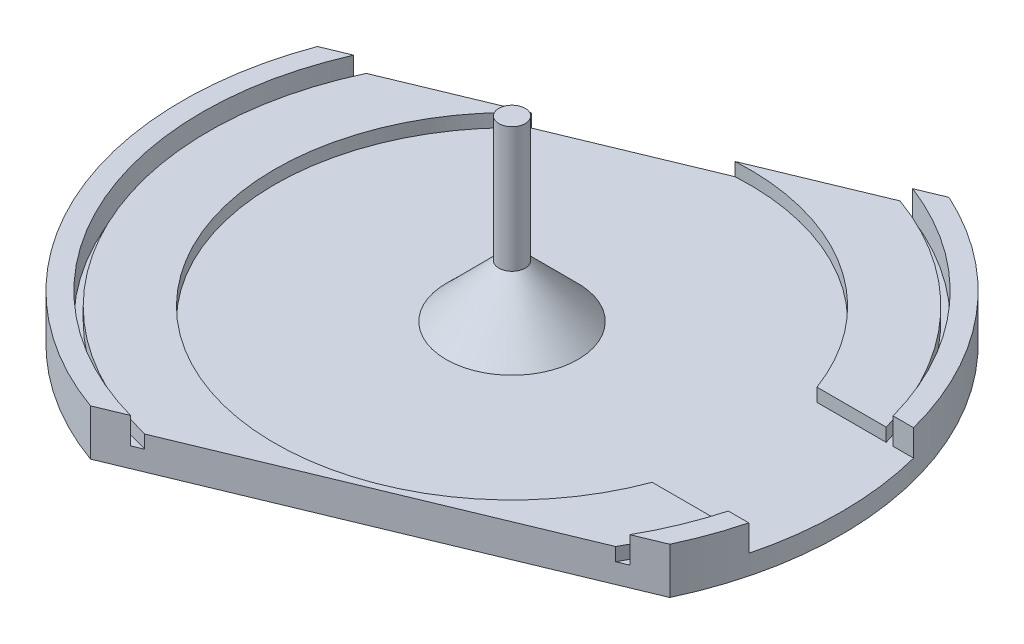
ISO-10303-21;
HEADER;
FILE_DESCRIPTION(('STEP AP214'),'2;1');
FILE_NAME('part.step','',(''),(''),'','','');
FILE_SCHEMA(('AUTOMOTIVE_DESIGN { 1 0 10303 214 1 1 1 1 }'));
ENDSEC;
DATA;
#1=APPLICATION_CONTEXT('core data for automotive mechanical design processes');
#2=APPLICATION_PROTOCOL_DEFINITION('international standard','automotive_design',2000,#1);
#3=PRODUCT_CONTEXT('',#1,'mechanical');
#4=PRODUCT('Part','Part','',(#3));
#5=PRODUCT_RELATED_PRODUCT_CATEGORY('part','',(#4));
#6=PRODUCT_DEFINITION_FORMATION('','',#4);
#7=PRODUCT_DEFINITION_CONTEXT('part definition',#1,'design');
#8=PRODUCT_DEFINITION('design','',#6,#7);
#9=PRODUCT_DEFINITION_SHAPE('','',#8);
#10=(LENGTH_UNIT() NAMED_UNIT(*) SI_UNIT(.MILLI.,.METRE.));
#11=(NAMED_UNIT(*) PLANE_ANGLE_UNIT() SI_UNIT($,.RADIAN.));
#12=(NAMED_UNIT(*) SI_UNIT($,.STERADIAN.) SOLID_ANGLE_UNIT());
#13=UNCERTAINTY_MEASURE_WITH_UNIT(LENGTH_MEASURE(1.E-05),#10,'distance_accuracy_value','');
#14=(GEOMETRIC_REPRESENTATION_CONTEXT(3) GLOBAL_UNCERTAINTY_ASSIGNED_CONTEXT((#13)) GLOBAL_UNIT_ASSIGNED_CONTEXT((#10,
#11,#12)) REPRESENTATION_CONTEXT('',''));
#15=CARTESIAN_POINT('',(0.,0.,0.));
#16=DIRECTION('',(0.,0.,1.));
#17=DIRECTION('',(1.,0.,0.));
#18=AXIS2_PLACEMENT_3D('',#15,#16,#17);
#19=CARTESIAN_POINT('',(0.,3.,0.));
#20=DIRECTION('',(0.,-1.,0.));
#21=DIRECTION('',(0.,0.,-1.));
#22=AXIS2_PLACEMENT_3D('',#19,#20,#21);
#23=CYLINDRICAL_SURFACE('',#22,50.);
#24=DIRECTION('',(0.,-1.,0.));
#25=VECTOR('',#24,1.);
#26=CARTESIAN_POINT('',(-46.8880949091429,10.,-17.3639441311934));
#27=LINE('',#26,#25);
#28=CARTESIAN_POINT('',(-46.8880949091429,7.,-17.3639441311934));
#29=VERTEX_POINT('',#28);
#30=CARTESIAN_POINT('',(-46.8880949091429,0.,-17.3639441311934));
#31=VERTEX_POINT('',#30);
#32=EDGE_CURVE('E225',#29,#31,#27,.T.);
#33=ORIENTED_EDGE('',*,*,#32,.T.);
#34=CARTESIAN_POINT('',(0.,0.,0.));
#35=DIRECTION('',(0.,1.,0.));
#36=DIRECTION('',(0.,0.,1.));
#37=AXIS2_PLACEMENT_3D('',#34,#35,#36);
#38=CIRCLE('',#37,50.);
#39=CARTESIAN_POINT('',(-16.8924773061934,0.,47.0600064859722));
#40=VERTEX_POINT('',#39);
#41=EDGE_CURVE('E239',#31,#40,#38,.T.);
#42=ORIENTED_EDGE('',*,*,#41,.T.);
#43=DIRECTION('',(0.,-1.,0.));
#44=VECTOR('',#43,1.);
#45=CARTESIAN_POINT('',(-16.8924773061934,10.,47.0600064859722));
#46=LINE('',#45,#44);
#47=CARTESIAN_POINT('',(-16.8924773061934,7.,47.0600064859722));
#48=VERTEX_POINT('',#47);
#49=EDGE_CURVE('E233',#48,#40,#46,.T.);
#50=ORIENTED_EDGE('',*,*,#49,.F.);
#51=CARTESIAN_POINT('',(0.,7.,0.));
#52=DIRECTION('',(0.,1.,0.));
#53=DIRECTION('',(0.,0.,1.));
#54=AXIS2_PLACEMENT_3D('',#51,#52,#53);
#55=CIRCLE('',#54,50.);
#56=EDGE_CURVE('E241',#29,#48,#55,.T.);
#57=ORIENTED_EDGE('',*,*,#56,.F.);
#58=EDGE_LOOP('',(#33,#42,#50,#57));
#59=FACE_BOUND('',#58,.T.);
#60=ADVANCED_FACE('F75',(#59),#23,.T.);
#61=CARTESIAN_POINT('',(0.,7.,0.));
#62=DIRECTION('',(0.,1.,0.));
#63=DIRECTION('',(0.,0.,1.));
#64=AXIS2_PLACEMENT_3D('',#61,#62,#63);
#65=PLANE('',#64);
#66=CARTESIAN_POINT('',(0.,7.,0.));
#67=DIRECTION('',(0.,1.,0.));
#68=DIRECTION('',(0.,0.,1.));
#69=AXIS2_PLACEMENT_3D('',#66,#67,#68);
#70=CIRCLE('',#69,47.);
#71=CARTESIAN_POINT('',(-42.9986049840917,7.,-18.9768271695256));
#72=VERTEX_POINT('',#71);
#73=CARTESIAN_POINT('',(-12.5993682383666,7.,45.2797517660382));
#74=VERTEX_POINT('',#73);
#75=EDGE_CURVE('E351',#72,#74,#70,.T.);
#76=ORIENTED_EDGE('',*,*,#75,.F.);
#77=DIRECTION('',(-0.923728021347068,0.,0.383049008063237));
#78=VECTOR('',#77,1.);
#79=CARTESIAN_POINT('',(-13.0236662741541,7.,-31.40675272581));
#80=LINE('',#79,#78);
#81=EDGE_CURVE('E416',#72,#29,#80,.T.);
#82=ORIENTED_EDGE('',*,*,#81,.T.);
#83=ORIENTED_EDGE('',*,*,#56,.T.);
#84=DIRECTION('',(0.923728021347069,0.,-0.383049008063236));
#85=VECTOR('',#84,1.);
#86=CARTESIAN_POINT('',(14.1728132983394,7.,34.1779367898408));
#87=LINE('',#86,#85);
#88=EDGE_CURVE('E433',#48,#74,#87,.T.);
#89=ORIENTED_EDGE('',*,*,#88,.T.);
#90=EDGE_LOOP('',(#76,#82,#83,#89));
#91=FACE_BOUND('',#90,.T.);
#92=ADVANCED_FACE('F451',(#91),#65,.T.);
#93=CARTESIAN_POINT('',(40.9449948350454,7.,23.0761218136434));
#94=VERTEX_POINT('',#93);
#95=CARTESIAN_POINT('',(45.3072841825683,7.,12.5));
#96=VERTEX_POINT('',#95);
#97=EDGE_CURVE('E348',#94,#96,#70,.T.);
#98=ORIENTED_EDGE('',*,*,#97,.F.);
#99=DIRECTION('',(0.923728021347069,0.,-0.383049008063236));
#100=VECTOR('',#99,1.);
#101=CARTESIAN_POINT('',(14.1728132983394,7.,34.1779367898408));
#102=LINE('',#101,#100);
#103=CARTESIAN_POINT('',(45.2381039028722,7.,21.2958670937095));
#104=VERTEX_POINT('',#103);
#105=EDGE_CURVE('E372',#94,#104,#102,.T.);
#106=ORIENTED_EDGE('',*,*,#105,.T.);
#107=CARTESIAN_POINT('',(48.4122918275927,7.,12.5));
#108=VERTEX_POINT('',#107);
#109=EDGE_CURVE('E252',#104,#108,#55,.T.);
#110=ORIENTED_EDGE('',*,*,#109,.T.);
#111=DIRECTION('',(1.,0.,0.));
#112=VECTOR('',#111,1.);
#113=CARTESIAN_POINT('',(0.,7.,12.5));
#114=LINE('',#113,#112);
#115=EDGE_CURVE('E327',#96,#108,#114,.T.);
#116=ORIENTED_EDGE('',*,*,#115,.F.);
#117=EDGE_LOOP('',(#98,#106,#110,#116));
#118=FACE_BOUND('',#117,.T.);
#119=ADVANCED_FACE('F370',(#118),#65,.T.);
#120=CARTESIAN_POINT('',(0.,7.,0.));
#121=DIRECTION('',(0.,-1.,0.));
#122=DIRECTION('',(0.,0.,-1.));
#123=AXIS2_PLACEMENT_3D('',#120,#121,#122);
#124=CYLINDRICAL_SURFACE('',#123,47.);
#125=CARTESIAN_POINT('',(0.,3.,0.));
#126=DIRECTION('',(0.,1.,0.));
#127=DIRECTION('',(0.,0.,1.));
#128=AXIS2_PLACEMENT_3D('',#125,#126,#127);
#129=CIRCLE('',#128,47.);
#130=CARTESIAN_POINT('',(-12.5993682383666,3.,45.2797517660382));
#131=VERTEX_POINT('',#130);
#132=CARTESIAN_POINT('',(-42.9986049840917,3.,-18.9768271695256));
#133=VERTEX_POINT('',#132);
#134=EDGE_CURVE('E259',#131,#133,#129,.F.);
#135=ORIENTED_EDGE('',*,*,#134,.T.);
#136=DIRECTION('',(0.,-1.,0.));
#137=VECTOR('',#136,1.);
#138=CARTESIAN_POINT('',(-42.9986049840917,7.,-18.9768271695256));
#139=LINE('',#138,#137);
#140=EDGE_CURVE('E402',#133,#72,#139,.F.);
#141=ORIENTED_EDGE('',*,*,#140,.T.);
#142=ORIENTED_EDGE('',*,*,#75,.T.);
#143=DIRECTION('',(0.,-1.,0.));
#144=VECTOR('',#143,1.);
#145=CARTESIAN_POINT('',(-12.5993682383666,7.,45.2797517660382));
#146=LINE('',#145,#144);
#147=EDGE_CURVE('E404',#74,#131,#146,.T.);
#148=ORIENTED_EDGE('',*,*,#147,.T.);
#149=EDGE_LOOP('',(#135,#141,#142,#148));
#150=FACE_BOUND('',#149,.T.);
#151=ADVANCED_FACE('F401',(#150),#124,.F.);
#152=CARTESIAN_POINT('',(45.3072841825683,3.00000000000001,12.5));
#153=VERTEX_POINT('',#152);
#154=CARTESIAN_POINT('',(40.9449948350454,3.,23.0761218136434));
#155=VERTEX_POINT('',#154);
#156=EDGE_CURVE('E255',#153,#155,#129,.F.);
#157=ORIENTED_EDGE('',*,*,#156,.T.);
#158=DIRECTION('',(0.,-1.,0.));
#159=VECTOR('',#158,1.);
#160=CARTESIAN_POINT('',(40.9449948350454,7.,23.0761218136434));
#161=LINE('',#160,#159);
#162=EDGE_CURVE('E363',#155,#94,#161,.F.);
#163=ORIENTED_EDGE('',*,*,#162,.T.);
#164=ORIENTED_EDGE('',*,*,#97,.T.);
#165=DIRECTION('',(0.,-1.,0.));
#166=VECTOR('',#165,1.);
#167=CARTESIAN_POINT('',(45.3072841825683,7.,12.5));
#168=LINE('',#167,#166);
#169=EDGE_CURVE('E324',#153,#96,#168,.F.);
#170=ORIENTED_EDGE('',*,*,#169,.F.);
#171=EDGE_LOOP('',(#157,#163,#164,#170));
#172=FACE_BOUND('',#171,.T.);
#173=ADVANCED_FACE('F361',(#172),#124,.F.);
#174=CARTESIAN_POINT('',(0.,3.,0.));
#175=DIRECTION('',(0.,1.,0.));
#176=DIRECTION('',(0.,0.,1.));
#177=AXIS2_PLACEMENT_3D('',#174,#175,#176);
#178=PLANE('',#177);
#179=CARTESIAN_POINT('',(0.,3.,0.));
#180=DIRECTION('',(0.,1.,0.));
#181=DIRECTION('',(0.,0.,1.));
#182=AXIS2_PLACEMENT_3D('',#179,#180,#181);
#183=CIRCLE('',#182,46.);
#184=CARTESIAN_POINT('',(-41.6443322189621,3.,-19.5384132937328));
#185=VERTEX_POINT('',#184);
#186=CARTESIAN_POINT('',(-11.0738750526922,3.,44.6471644263929));
#187=VERTEX_POINT('',#186);
#188=EDGE_CURVE('E346',#185,#187,#183,.T.);
#189=ORIENTED_EDGE('',*,*,#188,.F.);
#190=DIRECTION('',(-0.923728021347068,0.,0.383049008063237));
#191=VECTOR('',#190,1.);
#192=CARTESIAN_POINT('',(-13.0236662741541,3.,-31.40675272581));
#193=LINE('',#192,#191);
#194=EDGE_CURVE('E412',#185,#133,#193,.T.);
#195=ORIENTED_EDGE('',*,*,#194,.T.);
#196=ORIENTED_EDGE('',*,*,#134,.F.);
#197=DIRECTION('',(0.923728021347069,0.,-0.383049008063236));
#198=VECTOR('',#197,1.);
#199=CARTESIAN_POINT('',(14.1728132983394,3.,34.1779367898408));
#200=LINE('',#199,#198);
#201=EDGE_CURVE('E410',#131,#187,#200,.T.);
#202=ORIENTED_EDGE('',*,*,#201,.T.);
#203=EDGE_LOOP('',(#189,#195,#196,#202));
#204=FACE_BOUND('',#203,.T.);
#205=ADVANCED_FACE('F409',(#204),#178,.T.);
#206=CARTESIAN_POINT('',(0.,5.,0.));
#207=DIRECTION('',(0.,-1.,0.));
#208=DIRECTION('',(0.,0.,-1.));
#209=AXIS2_PLACEMENT_3D('',#206,#207,#208);
#210=CYLINDRICAL_SURFACE('',#209,46.);
#211=DIRECTION('',(0.,-1.,0.));
#212=VECTOR('',#211,1.);
#213=CARTESIAN_POINT('',(-41.6443322189621,5.,-19.5384132937328));
#214=LINE('',#213,#212);
#215=CARTESIAN_POINT('',(-41.6443322189621,5.,-19.5384132937328));
#216=VERTEX_POINT('',#215);
#217=EDGE_CURVE('E414',#185,#216,#214,.F.);
#218=ORIENTED_EDGE('',*,*,#217,.F.);
#219=ORIENTED_EDGE('',*,*,#188,.T.);
#220=DIRECTION('',(0.,-1.,0.));
#221=VECTOR('',#220,1.);
#222=CARTESIAN_POINT('',(-11.0738750526922,5.,44.6471644263929));
#223=LINE('',#222,#221);
#224=CARTESIAN_POINT('',(-11.0738750526922,5.,44.6471644263929));
#225=VERTEX_POINT('',#224);
#226=EDGE_CURVE('E429',#225,#187,#223,.T.);
#227=ORIENTED_EDGE('',*,*,#226,.F.);
#228=CARTESIAN_POINT('',(0.,5.,0.));
#229=DIRECTION('',(0.,1.,0.));
#230=DIRECTION('',(0.,0.,1.));
#231=AXIS2_PLACEMENT_3D('',#228,#229,#230);
#232=CIRCLE('',#231,46.);
#233=EDGE_CURVE('E343',#216,#225,#232,.T.);
#234=ORIENTED_EDGE('',*,*,#233,.F.);
#235=EDGE_LOOP('',(#218,#219,#227,#234));
#236=FACE_BOUND('',#235,.T.);
#237=ADVANCED_FACE('F449',(#236),#210,.T.);
#238=DIRECTION('',(0.,-1.,0.));
#239=VECTOR('',#238,1.);
#240=CARTESIAN_POINT('',(39.419501649371,5.,23.7087091532887));
#241=LINE('',#240,#239);
#242=CARTESIAN_POINT('',(39.419501649371,3.,23.7087091532887));
#243=VERTEX_POINT('',#242);
#244=CARTESIAN_POINT('',(39.419501649371,5.,23.7087091532887));
#245=VERTEX_POINT('',#244);
#246=EDGE_CURVE('E91',#243,#245,#241,.F.);
#247=ORIENTED_EDGE('',*,*,#246,.F.);
#248=CARTESIAN_POINT('',(44.2690636901211,3.00000000000001,12.5));
#249=VERTEX_POINT('',#248);
#250=EDGE_CURVE('E338',#243,#249,#183,.T.);
#251=ORIENTED_EDGE('',*,*,#250,.T.);
#252=DIRECTION('',(0.,-1.,0.));
#253=VECTOR('',#252,1.);
#254=CARTESIAN_POINT('',(44.2690636901211,5.,12.5));
#255=LINE('',#254,#253);
#256=CARTESIAN_POINT('',(44.2690636901211,5.,12.5));
#257=VERTEX_POINT('',#256);
#258=EDGE_CURVE('E321',#249,#257,#255,.F.);
#259=ORIENTED_EDGE('',*,*,#258,.T.);
#260=EDGE_CURVE('E344',#245,#257,#232,.T.);
#261=ORIENTED_EDGE('',*,*,#260,.F.);
#262=EDGE_LOOP('',(#247,#251,#259,#261));
#263=FACE_BOUND('',#262,.T.);
#264=ADVANCED_FACE('F439',(#263),#210,.T.);
#265=DIRECTION('',(0.,-1.,0.));
#266=VECTOR('',#265,1.);
#267=CARTESIAN_POINT('',(20.8407623608348,10.,-45.4495613204265));
#268=LINE('',#267,#266);
#269=CARTESIAN_POINT('',(20.8407623608348,7.,-45.4495613204265));
#270=VERTEX_POINT('',#269);
#271=CARTESIAN_POINT('',(20.8407623608348,0.,-45.4495613204265));
#272=VERTEX_POINT('',#271);
#273=EDGE_CURVE('E228',#270,#272,#268,.T.);
#274=ORIENTED_EDGE('',*,*,#273,.F.);
#275=CARTESIAN_POINT('',(48.4122918275927,7.,-12.5));
#276=VERTEX_POINT('',#275);
#277=EDGE_CURVE('E247',#276,#270,#55,.T.);
#278=ORIENTED_EDGE('',*,*,#277,.F.);
#279=DIRECTION('',(0.,-1.,0.));
#280=VECTOR('',#279,1.);
#281=CARTESIAN_POINT('',(48.4122918275927,3.,-12.5));
#282=LINE('',#281,#280);
#283=CARTESIAN_POINT('',(48.4122918275927,3.00000000000001,-12.5));
#284=VERTEX_POINT('',#283);
#285=EDGE_CURVE('E312',#276,#284,#282,.T.);
#286=ORIENTED_EDGE('',*,*,#285,.T.);
#287=CARTESIAN_POINT('',(0.,3.00000000000001,0.));
#288=DIRECTION('',(0.,-1.,0.));
#289=DIRECTION('',(0.,0.,-1.));
#290=AXIS2_PLACEMENT_3D('',#287,#288,#289);
#291=CIRCLE('',#290,50.);
#292=CARTESIAN_POINT('',(48.4122918275927,3.00000000000001,12.5));
#293=VERTEX_POINT('',#292);
#294=EDGE_CURVE('E333',#284,#293,#291,.T.);
#295=ORIENTED_EDGE('',*,*,#294,.T.);
#296=DIRECTION('',(0.,-1.,0.));
#297=VECTOR('',#296,1.);
#298=CARTESIAN_POINT('',(48.4122918275927,3.,12.5));
#299=LINE('',#298,#297);
#300=EDGE_CURVE('E330',#293,#108,#299,.F.);
#301=ORIENTED_EDGE('',*,*,#300,.T.);
#302=ORIENTED_EDGE('',*,*,#109,.F.);
#303=DIRECTION('',(0.,-1.,0.));
#304=VECTOR('',#303,1.);
#305=CARTESIAN_POINT('',(45.2381039028722,10.,21.2958670937095));
#306=LINE('',#305,#304);
#307=CARTESIAN_POINT('',(45.2381039028722,0.,21.2958670937095));
#308=VERTEX_POINT('',#307);
#309=EDGE_CURVE('E376',#104,#308,#306,.T.);
#310=ORIENTED_EDGE('',*,*,#309,.T.);
#311=EDGE_CURVE('E246',#308,#272,#38,.T.);
#312=ORIENTED_EDGE('',*,*,#311,.T.);
#313=EDGE_LOOP('',(#274,#278,#286,#295,#301,#302,#310,#312));
#314=FACE_BOUND('',#313,.T.);
#315=ADVANCED_FACE('F375',(#314),#23,.T.);
#316=CARTESIAN_POINT('',(0.,0.,0.));
#317=DIRECTION('',(0.,1.,0.));
#318=DIRECTION('',(0.,0.,1.));
#319=AXIS2_PLACEMENT_3D('',#316,#317,#318);
#320=PLANE('',#319);
#321=DIRECTION('',(0.923728021347069,0.,-0.383049008063237));
#322=VECTOR('',#321,1.);
#323=CARTESIAN_POINT('',(-13.0236662741541,0.,-31.40675272581));
#324=LINE('',#323,#322);
#325=EDGE_CURVE('E222',#31,#272,#324,.T.);
#326=ORIENTED_EDGE('',*,*,#325,.T.);
#327=ORIENTED_EDGE('',*,*,#311,.F.);
#328=DIRECTION('',(-0.923728021347069,0.,0.383049008063236));
#329=VECTOR('',#328,1.);
#330=CARTESIAN_POINT('',(14.1728132983394,0.,34.1779367898408));
#331=LINE('',#330,#329);
#332=EDGE_CURVE('E245',#308,#40,#331,.T.);
#333=ORIENTED_EDGE('',*,*,#332,.T.);
#334=ORIENTED_EDGE('',*,*,#41,.F.);
#335=EDGE_LOOP('',(#326,#327,#333,#334));
#336=FACE_BOUND('',#335,.T.);
#337=ADVANCED_FACE('F244',(#336),#320,.F.);
#338=ORIENTED_EDGE('',*,*,#277,.T.);
#339=DIRECTION('',(-0.923728021347068,0.,0.383049008063237));
#340=VECTOR('',#339,1.);
#341=CARTESIAN_POINT('',(-13.0236662741541,7.,-31.40675272581));
#342=LINE('',#341,#340);
#343=CARTESIAN_POINT('',(16.9512724357836,7.,-43.8366782820944));
#344=VERTEX_POINT('',#343);
#345=EDGE_CURVE('E393',#270,#344,#342,.T.);
#346=ORIENTED_EDGE('',*,*,#345,.T.);
#347=CARTESIAN_POINT('',(45.3072841825683,7.,-12.5));
#348=VERTEX_POINT('',#347);
#349=EDGE_CURVE('E349',#348,#344,#70,.T.);
#350=ORIENTED_EDGE('',*,*,#349,.F.);
#351=DIRECTION('',(-1.,0.,0.));
#352=VECTOR('',#351,1.);
#353=CARTESIAN_POINT('',(0.,7.,-12.5));
#354=LINE('',#353,#352);
#355=EDGE_CURVE('E310',#276,#348,#354,.T.);
#356=ORIENTED_EDGE('',*,*,#355,.F.);
#357=EDGE_LOOP('',(#338,#346,#350,#356));
#358=FACE_BOUND('',#357,.T.);
#359=ADVANCED_FACE('F392',(#358),#65,.T.);
#360=ORIENTED_EDGE('',*,*,#349,.T.);
#361=DIRECTION('',(0.,-1.,0.));
#362=VECTOR('',#361,1.);
#363=CARTESIAN_POINT('',(16.9512724357836,7.,-43.8366782820944));
#364=LINE('',#363,#362);
#365=CARTESIAN_POINT('',(16.9512724357836,3.,-43.8366782820944));
#366=VERTEX_POINT('',#365);
#367=EDGE_CURVE('E395',#344,#366,#364,.T.);
#368=ORIENTED_EDGE('',*,*,#367,.T.);
#369=CARTESIAN_POINT('',(45.3072841825683,3.,-12.5));
#370=VERTEX_POINT('',#369);
#371=EDGE_CURVE('E249',#366,#370,#129,.F.);
#372=ORIENTED_EDGE('',*,*,#371,.T.);
#373=DIRECTION('',(0.,-1.,0.));
#374=VECTOR('',#373,1.);
#375=CARTESIAN_POINT('',(45.3072841825683,7.,-12.5));
#376=LINE('',#375,#374);
#377=EDGE_CURVE('E307',#348,#370,#376,.T.);
#378=ORIENTED_EDGE('',*,*,#377,.F.);
#379=EDGE_LOOP('',(#360,#368,#372,#378));
#380=FACE_BOUND('',#379,.T.);
#381=ADVANCED_FACE('F394',(#380),#124,.F.);
#382=CARTESIAN_POINT('',(0.,3.,0.));
#383=DIRECTION('',(0.,1.,0.));
#384=DIRECTION('',(0.,0.,1.));
#385=AXIS2_PLACEMENT_3D('',#382,#383,#384);
#386=CIRCLE('',#385,9.99999999999997);
#387=CARTESIAN_POINT('',(0.,3.,9.99999999999997));
#388=VERTEX_POINT('',#387);
#389=EDGE_CURVE('E262',#388,#388,#386,.F.);
#390=ORIENTED_EDGE('',*,*,#389,.T.);
#391=EDGE_LOOP('',(#390));
#392=FACE_BOUND('',#391,.T.);
#393=ORIENTED_EDGE('',*,*,#371,.F.);
#394=DIRECTION('',(-0.923728021347068,0.,0.383049008063237));
#395=VECTOR('',#394,1.);
#396=CARTESIAN_POINT('',(-13.0236662741541,3.,-31.40675272581));
#397=LINE('',#396,#395);
#398=CARTESIAN_POINT('',(15.596999670654,3.,-43.2750921578871));
#399=VERTEX_POINT('',#398);
#400=EDGE_CURVE('E425',#366,#399,#397,.T.);
#401=ORIENTED_EDGE('',*,*,#400,.T.);
#402=CARTESIAN_POINT('',(44.2690636901211,3.00000000000001,-12.5));
#403=VERTEX_POINT('',#402);
#404=EDGE_CURVE('E291',#403,#399,#183,.T.);
#405=ORIENTED_EDGE('',*,*,#404,.F.);
#406=DIRECTION('',(1.,0.,0.));
#407=VECTOR('',#406,1.);
#408=CARTESIAN_POINT('',(21.,3.00000000000001,-12.5));
#409=LINE('',#408,#407);
#410=CARTESIAN_POINT('',(33.7601836487896,3.,-12.5));
#411=VERTEX_POINT('',#410);
#412=EDGE_CURVE('E287',#411,#403,#409,.T.);
#413=ORIENTED_EDGE('',*,*,#412,.F.);
#414=CARTESIAN_POINT('',(0.,3.,0.));
#415=DIRECTION('',(0.,1.,0.));
#416=DIRECTION('',(0.,0.,1.));
#417=AXIS2_PLACEMENT_3D('',#414,#415,#416);
#418=CIRCLE('',#417,36.);
#419=CARTESIAN_POINT('',(-2.09396892983373,3.,-35.939049710877));
#420=VERTEX_POINT('',#419);
#421=EDGE_CURVE('E265',#420,#411,#418,.F.);
#422=ORIENTED_EDGE('',*,*,#421,.F.);
#423=CARTESIAN_POINT('',(-23.9533636184744,3.,-26.8744557407429));
#424=VERTEX_POINT('',#423);
#425=EDGE_CURVE('E285',#420,#424,#397,.T.);
#426=ORIENTED_EDGE('',*,*,#425,.T.);
#427=CARTESIAN_POINT('',(33.7601836487896,3.00000000000001,12.5));
#428=VERTEX_POINT('',#427);
#429=EDGE_CURVE('E266',#428,#424,#418,.F.);
#430=ORIENTED_EDGE('',*,*,#429,.F.);
#431=DIRECTION('',(1.,0.,0.));
#432=VECTOR('',#431,1.);
#433=CARTESIAN_POINT('',(21.,3.00000000000001,12.5));
#434=LINE('',#433,#432);
#435=EDGE_CURVE('E380',#428,#249,#434,.T.);
#436=ORIENTED_EDGE('',*,*,#435,.T.);
#437=ORIENTED_EDGE('',*,*,#250,.F.);
#438=DIRECTION('',(0.923728021347069,0.,-0.383049008063236));
#439=VECTOR('',#438,1.);
#440=CARTESIAN_POINT('',(14.1728132983394,3.,34.1779367898408));
#441=LINE('',#440,#439);
#442=EDGE_CURVE('E383',#243,#155,#441,.T.);
#443=ORIENTED_EDGE('',*,*,#442,.T.);
#444=ORIENTED_EDGE('',*,*,#156,.F.);
#445=EDGE_CURVE('E304',#153,#293,#434,.T.);
#446=ORIENTED_EDGE('',*,*,#445,.T.);
#447=ORIENTED_EDGE('',*,*,#294,.F.);
#448=EDGE_CURVE('E295',#370,#284,#409,.T.);
#449=ORIENTED_EDGE('',*,*,#448,.F.);
#450=EDGE_LOOP('',(#393,#401,#405,#413,#422,#426,#430,#436,#437,#443,#444,#446,#447,#449));
#451=FACE_BOUND('',#450,.T.);
#452=ADVANCED_FACE('F283',(#392,#451),#178,.T.);
#453=CARTESIAN_POINT('',(0.,5.,0.));
#454=DIRECTION('',(0.,1.,0.));
#455=DIRECTION('',(0.,0.,1.));
#456=AXIS2_PLACEMENT_3D('',#453,#454,#455);
#457=PLANE('',#456);
#458=CARTESIAN_POINT('',(44.2690636901211,5.,-12.5));
#459=VERTEX_POINT('',#458);
#460=CARTESIAN_POINT('',(15.596999670654,5.,-43.2750921578871));
#461=VERTEX_POINT('',#460);
#462=EDGE_CURVE('E339',#459,#461,#232,.T.);
#463=ORIENTED_EDGE('',*,*,#462,.T.);
#464=DIRECTION('',(-0.923728021347068,0.,0.383049008063237));
#465=VECTOR('',#464,1.);
#466=CARTESIAN_POINT('',(-13.0236662741541,5.,-31.40675272581));
#467=LINE('',#466,#465);
#468=CARTESIAN_POINT('',(-2.09396892983373,5.,-35.939049710877));
#469=VERTEX_POINT('',#468);
#470=EDGE_CURVE('E422',#461,#469,#467,.T.);
#471=ORIENTED_EDGE('',*,*,#470,.T.);
#472=CARTESIAN_POINT('',(0.,5.,0.));
#473=DIRECTION('',(0.,1.,0.));
#474=DIRECTION('',(0.,0.,1.));
#475=AXIS2_PLACEMENT_3D('',#472,#473,#474);
#476=CIRCLE('',#475,36.);
#477=CARTESIAN_POINT('',(33.7601836487896,5.,-12.5));
#478=VERTEX_POINT('',#477);
#479=EDGE_CURVE('E278',#478,#469,#476,.T.);
#480=ORIENTED_EDGE('',*,*,#479,.F.);
#481=DIRECTION('',(-1.,0.,0.));
#482=VECTOR('',#481,1.);
#483=CARTESIAN_POINT('',(0.,5.,-12.5));
#484=LINE('',#483,#482);
#485=EDGE_CURVE('E299',#459,#478,#484,.T.);
#486=ORIENTED_EDGE('',*,*,#485,.F.);
#487=EDGE_LOOP('',(#463,#471,#480,#486));
#488=FACE_BOUND('',#487,.T.);
#489=ADVANCED_FACE('F477',(#488),#457,.T.);
#490=CARTESIAN_POINT('',(-23.9533636184744,5.,-26.8744557407429));
#491=VERTEX_POINT('',#490);
#492=CARTESIAN_POINT('',(33.7601836487896,5.,12.5));
#493=VERTEX_POINT('',#492);
#494=EDGE_CURVE('E336',#491,#493,#476,.T.);
#495=ORIENTED_EDGE('',*,*,#494,.F.);
#496=EDGE_CURVE('E98',#491,#216,#467,.T.);
#497=ORIENTED_EDGE('',*,*,#496,.T.);
#498=ORIENTED_EDGE('',*,*,#233,.T.);
#499=DIRECTION('',(0.923728021347069,0.,-0.383049008063236));
#500=VECTOR('',#499,1.);
#501=CARTESIAN_POINT('',(14.1728132983394,5.,34.1779367898408));
#502=LINE('',#501,#500);
#503=EDGE_CURVE('E12',#225,#245,#502,.T.);
#504=ORIENTED_EDGE('',*,*,#503,.T.);
#505=ORIENTED_EDGE('',*,*,#260,.T.);
#506=DIRECTION('',(1.,0.,0.));
#507=VECTOR('',#506,1.);
#508=CARTESIAN_POINT('',(0.,5.,12.5));
#509=LINE('',#508,#507);
#510=EDGE_CURVE('E318',#493,#257,#509,.T.);
#511=ORIENTED_EDGE('',*,*,#510,.F.);
#512=EDGE_LOOP('',(#495,#497,#498,#504,#505,#511));
#513=FACE_BOUND('',#512,.T.);
#514=ADVANCED_FACE('F446',(#513),#457,.T.);
#515=DIRECTION('',(0.,-1.,0.));
#516=VECTOR('',#515,1.);
#517=CARTESIAN_POINT('',(15.596999670654,5.,-43.2750921578871));
#518=LINE('',#517,#516);
#519=EDGE_CURVE('E423',#461,#399,#518,.T.);
#520=ORIENTED_EDGE('',*,*,#519,.F.);
#521=ORIENTED_EDGE('',*,*,#462,.F.);
#522=DIRECTION('',(0.,-1.,0.));
#523=VECTOR('',#522,1.);
#524=CARTESIAN_POINT('',(44.2690636901211,5.,-12.5));
#525=LINE('',#524,#523);
#526=EDGE_CURVE('E301',#459,#403,#525,.T.);
#527=ORIENTED_EDGE('',*,*,#526,.T.);
#528=ORIENTED_EDGE('',*,*,#404,.T.);
#529=EDGE_LOOP('',(#520,#521,#527,#528));
#530=FACE_BOUND('',#529,.T.);
#531=ADVANCED_FACE('F475',(#530),#210,.T.);
#532=CARTESIAN_POINT('',(0.,5.,0.));
#533=DIRECTION('',(0.,-1.,0.));
#534=DIRECTION('',(0.,0.,-1.));
#535=AXIS2_PLACEMENT_3D('',#532,#533,#534);
#536=CYLINDRICAL_SURFACE('',#535,36.);
#537=ORIENTED_EDGE('',*,*,#479,.T.);
#538=DIRECTION('',(0.,-1.,0.));
#539=VECTOR('',#538,1.);
#540=CARTESIAN_POINT('',(-2.09396892983373,5.,-35.939049710877));
#541=LINE('',#540,#539);
#542=EDGE_CURVE('E84',#469,#420,#541,.T.);
#543=ORIENTED_EDGE('',*,*,#542,.T.);
#544=ORIENTED_EDGE('',*,*,#421,.T.);
#545=DIRECTION('',(0.,-1.,0.));
#546=VECTOR('',#545,1.);
#547=CARTESIAN_POINT('',(33.7601836487896,5.,-12.5));
#548=LINE('',#547,#546);
#549=EDGE_CURVE('E294',#478,#411,#548,.T.);
#550=ORIENTED_EDGE('',*,*,#549,.F.);
#551=EDGE_LOOP('',(#537,#543,#544,#550));
#552=FACE_BOUND('',#551,.T.);
#553=ADVANCED_FACE('F274',(#552),#536,.F.);
#554=ORIENTED_EDGE('',*,*,#429,.T.);
#555=DIRECTION('',(0.,-1.,0.));
#556=VECTOR('',#555,1.);
#557=CARTESIAN_POINT('',(-23.9533636184744,5.,-26.8744557407429));
#558=LINE('',#557,#556);
#559=EDGE_CURVE('E269',#424,#491,#558,.F.);
#560=ORIENTED_EDGE('',*,*,#559,.T.);
#561=ORIENTED_EDGE('',*,*,#494,.T.);
#562=DIRECTION('',(0.,-1.,0.));
#563=VECTOR('',#562,1.);
#564=CARTESIAN_POINT('',(33.7601836487896,5.,12.5));
#565=LINE('',#564,#563);
#566=EDGE_CURVE('E315',#428,#493,#565,.F.);
#567=ORIENTED_EDGE('',*,*,#566,.F.);
#568=EDGE_LOOP('',(#554,#560,#561,#567));
#569=FACE_BOUND('',#568,.T.);
#570=ADVANCED_FACE('F498',(#569),#536,.F.);
#571=CARTESIAN_POINT('',(0.,30.,0.));
#572=DIRECTION('',(0.,1.,0.));
#573=DIRECTION('',(0.,0.,1.));
#574=AXIS2_PLACEMENT_3D('',#571,#572,#573);
#575=PLANE('',#574);
#576=CARTESIAN_POINT('',(0.,30.,0.));
#577=DIRECTION('',(0.,1.,0.));
#578=DIRECTION('',(0.,0.,1.));
#579=AXIS2_PLACEMENT_3D('',#576,#577,#578);
#580=CIRCLE('',#579,2.);
#581=CARTESIAN_POINT('',(0.,30.,2.));
#582=VERTEX_POINT('',#581);
#583=EDGE_CURVE('E342',#582,#582,#580,.T.);
#584=ORIENTED_EDGE('',*,*,#583,.T.);
#585=EDGE_LOOP('',(#584));
#586=FACE_BOUND('',#585,.T.);
#587=ADVANCED_FACE('F493',(#586),#575,.T.);
#588=CARTESIAN_POINT('',(0.,30.,0.));
#589=DIRECTION('',(0.,-1.,0.));
#590=DIRECTION('',(0.,0.,-1.));
#591=AXIS2_PLACEMENT_3D('',#588,#589,#590);
#592=CYLINDRICAL_SURFACE('',#591,2.);
#593=CARTESIAN_POINT('',(0.,11.0000000000001,0.));
#594=DIRECTION('',(0.,1.,0.));
#595=DIRECTION('',(0.,0.,1.));
#596=AXIS2_PLACEMENT_3D('',#593,#594,#595);
#597=CIRCLE('',#596,2.);
#598=CARTESIAN_POINT('',(0.,11.0000000000001,2.));
#599=VERTEX_POINT('',#598);
#600=EDGE_CURVE('E258',#599,#599,#597,.T.);
#601=ORIENTED_EDGE('',*,*,#600,.T.);
#602=EDGE_LOOP('',(#601));
#603=FACE_BOUND('',#602,.T.);
#604=ORIENTED_EDGE('',*,*,#583,.F.);
#605=EDGE_LOOP('',(#604));
#606=FACE_BOUND('',#605,.T.);
#607=ADVANCED_FACE('F488',(#603,#606),#592,.T.);
#608=CARTESIAN_POINT('',(0.,11.0000000000001,0.));
#609=DIRECTION('',(0.,-1.,0.));
#610=DIRECTION('',(0.,0.,-1.));
#611=AXIS2_PLACEMENT_3D('',#608,#609,#610);
#612=CONICAL_SURFACE('',#611,2.,0.785398163397443);
#613=ORIENTED_EDGE('',*,*,#389,.F.);
#614=EDGE_LOOP('',(#613));
#615=FACE_BOUND('',#614,.T.);
#616=ORIENTED_EDGE('',*,*,#600,.F.);
#617=EDGE_LOOP('',(#616));
#618=FACE_BOUND('',#617,.T.);
#619=ADVANCED_FACE('F78',(#615,#618),#612,.T.);
#620=CARTESIAN_POINT('',(21.,3.00000000000001,-12.5));
#621=DIRECTION('',(0.,0.,-1.));
#622=DIRECTION('',(-1.,0.,0.));
#623=AXIS2_PLACEMENT_3D('',#620,#621,#622);
#624=PLANE('',#623);
#625=ORIENTED_EDGE('',*,*,#485,.T.);
#626=ORIENTED_EDGE('',*,*,#549,.T.);
#627=ORIENTED_EDGE('',*,*,#412,.T.);
#628=ORIENTED_EDGE('',*,*,#526,.F.);
#629=EDGE_LOOP('',(#625,#626,#627,#628));
#630=FACE_BOUND('',#629,.T.);
#631=ADVANCED_FACE('F297',(#630),#624,.F.);
#632=CARTESIAN_POINT('',(21.,3.00000000000001,12.5));
#633=DIRECTION('',(0.,0.,1.));
#634=DIRECTION('',(1.,0.,0.));
#635=AXIS2_PLACEMENT_3D('',#632,#633,#634);
#636=PLANE('',#635);
#637=ORIENTED_EDGE('',*,*,#435,.F.);
#638=ORIENTED_EDGE('',*,*,#566,.T.);
#639=ORIENTED_EDGE('',*,*,#510,.T.);
#640=ORIENTED_EDGE('',*,*,#258,.F.);
#641=EDGE_LOOP('',(#637,#638,#639,#640));
#642=FACE_BOUND('',#641,.T.);
#643=ADVANCED_FACE('F599',(#642),#636,.F.);
#644=ORIENTED_EDGE('',*,*,#445,.F.);
#645=ORIENTED_EDGE('',*,*,#169,.T.);
#646=ORIENTED_EDGE('',*,*,#115,.T.);
#647=ORIENTED_EDGE('',*,*,#300,.F.);
#648=EDGE_LOOP('',(#644,#645,#646,#647));
#649=FACE_BOUND('',#648,.T.);
#650=ADVANCED_FACE('F368',(#649),#636,.F.);
#651=ORIENTED_EDGE('',*,*,#355,.T.);
#652=ORIENTED_EDGE('',*,*,#377,.T.);
#653=ORIENTED_EDGE('',*,*,#448,.T.);
#654=ORIENTED_EDGE('',*,*,#285,.F.);
#655=EDGE_LOOP('',(#651,#652,#653,#654));
#656=FACE_BOUND('',#655,.T.);
#657=ADVANCED_FACE('F387',(#656),#624,.F.);
#658=CARTESIAN_POINT('',(-13.0236662741541,10.,-31.40675272581));
#659=DIRECTION('',(-0.383049008063237,0.,-0.923728021347068));
#660=DIRECTION('',(-0.923728021347068,0.,0.383049008063237));
#661=AXIS2_PLACEMENT_3D('',#658,#659,#660);
#662=PLANE('',#661);
#663=ORIENTED_EDGE('',*,*,#273,.T.);
#664=ORIENTED_EDGE('',*,*,#325,.F.);
#665=ORIENTED_EDGE('',*,*,#32,.F.);
#666=ORIENTED_EDGE('',*,*,#81,.F.);
#667=ORIENTED_EDGE('',*,*,#140,.F.);
#668=ORIENTED_EDGE('',*,*,#194,.F.);
#669=ORIENTED_EDGE('',*,*,#217,.T.);
#670=ORIENTED_EDGE('',*,*,#496,.F.);
#671=ORIENTED_EDGE('',*,*,#559,.F.);
#672=ORIENTED_EDGE('',*,*,#425,.F.);
#673=ORIENTED_EDGE('',*,*,#542,.F.);
#674=ORIENTED_EDGE('',*,*,#470,.F.);
#675=ORIENTED_EDGE('',*,*,#519,.T.);
#676=ORIENTED_EDGE('',*,*,#400,.F.);
#677=ORIENTED_EDGE('',*,*,#367,.F.);
#678=ORIENTED_EDGE('',*,*,#345,.F.);
#679=EDGE_LOOP('',(#663,#664,#665,#666,#667,#668,#669,#670,#671,#672,#673,#674,#675,#676,#677,#678));
#680=FACE_BOUND('',#679,.T.);
#681=ADVANCED_FACE('F224',(#680),#662,.T.);
#682=CARTESIAN_POINT('',(14.1728132983394,10.,34.1779367898408));
#683=DIRECTION('',(0.383049008063236,0.,0.923728021347069));
#684=DIRECTION('',(0.923728021347069,0.,-0.383049008063236));
#685=AXIS2_PLACEMENT_3D('',#682,#683,#684);
#686=PLANE('',#685);
#687=ORIENTED_EDGE('',*,*,#162,.F.);
#688=ORIENTED_EDGE('',*,*,#442,.F.);
#689=ORIENTED_EDGE('',*,*,#246,.T.);
#690=ORIENTED_EDGE('',*,*,#503,.F.);
#691=ORIENTED_EDGE('',*,*,#226,.T.);
#692=ORIENTED_EDGE('',*,*,#201,.F.);
#693=ORIENTED_EDGE('',*,*,#147,.F.);
#694=ORIENTED_EDGE('',*,*,#88,.F.);
#695=ORIENTED_EDGE('',*,*,#49,.T.);
#696=ORIENTED_EDGE('',*,*,#332,.F.);
#697=ORIENTED_EDGE('',*,*,#309,.F.);
#698=ORIENTED_EDGE('',*,*,#105,.F.);
#699=EDGE_LOOP('',(#687,#688,#689,#690,#691,#692,#693,#694,#695,#696,#697,#698));
#700=FACE_BOUND('',#699,.T.);
#701=ADVANCED_FACE('F436',(#700),#686,.T.);
#702=CLOSED_SHELL('',(#60,#92,#119,#151,#173,#205,#237,#264,#315,#337,#359,#381,#452,#489,#514,
#531,#553,#570,#587,#607,#619,#631,#643,#650,#657,#681,#701));
#703=MANIFOLD_SOLID_BREP('B2',#702);
#704=ADVANCED_BREP_SHAPE_REPRESENTATION('',(#18,#703),#14);
#705=SHAPE_DEFINITION_REPRESENTATION(#9,#704);
ENDSEC;
END-ISO-10303-21;
